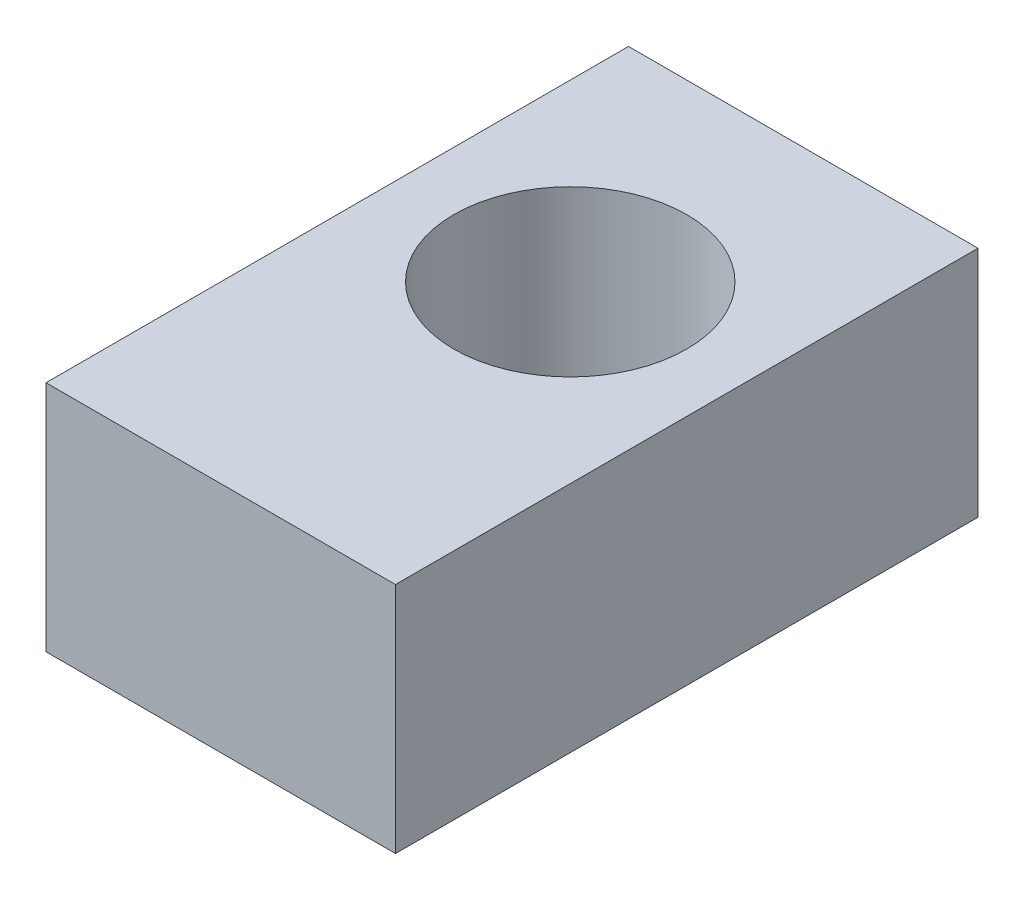
ISO-10303-21;
HEADER;
FILE_DESCRIPTION(('STEP AP214'),'2;1');
FILE_NAME('part.step','',(''),(''),'','','');
FILE_SCHEMA(('AUTOMOTIVE_DESIGN { 1 0 10303 214 1 1 1 1 }'));
ENDSEC;
DATA;
#1=APPLICATION_CONTEXT('core data for automotive mechanical design processes');
#2=APPLICATION_PROTOCOL_DEFINITION('international standard','automotive_design',2000,#1);
#3=PRODUCT_CONTEXT('',#1,'mechanical');
#4=PRODUCT('Part','Part','',(#3));
#5=PRODUCT_RELATED_PRODUCT_CATEGORY('part','',(#4));
#6=PRODUCT_DEFINITION_FORMATION('','',#4);
#7=PRODUCT_DEFINITION_CONTEXT('part definition',#1,'design');
#8=PRODUCT_DEFINITION('design','',#6,#7);
#9=PRODUCT_DEFINITION_SHAPE('','',#8);
#10=(LENGTH_UNIT() NAMED_UNIT(*) SI_UNIT(.MILLI.,.METRE.));
#11=(NAMED_UNIT(*) PLANE_ANGLE_UNIT() SI_UNIT($,.RADIAN.));
#12=(NAMED_UNIT(*) SI_UNIT($,.STERADIAN.) SOLID_ANGLE_UNIT());
#13=UNCERTAINTY_MEASURE_WITH_UNIT(LENGTH_MEASURE(1.E-05),#10,'distance_accuracy_value','');
#14=(GEOMETRIC_REPRESENTATION_CONTEXT(3) GLOBAL_UNCERTAINTY_ASSIGNED_CONTEXT((#13)) GLOBAL_UNIT_ASSIGNED_CONTEXT((#10,
#11,#12)) REPRESENTATION_CONTEXT('',''));
#15=CARTESIAN_POINT('',(0.,0.,0.));
#16=DIRECTION('',(0.,0.,1.));
#17=DIRECTION('',(1.,0.,0.));
#18=AXIS2_PLACEMENT_3D('',#15,#16,#17);
#19=CARTESIAN_POINT('',(0.,10.,0.));
#20=DIRECTION('',(0.,-1.,0.));
#21=DIRECTION('',(0.,0.,-1.));
#22=AXIS2_PLACEMENT_3D('',#19,#20,#21);
#23=PLANE('',#22);
#24=DIRECTION('',(1.,0.,0.));
#25=VECTOR('',#24,1.);
#26=CARTESIAN_POINT('',(30.,10.,0.));
#27=LINE('',#26,#25);
#28=CARTESIAN_POINT('',(0.,10.,0.));
#29=VERTEX_POINT('',#28);
#30=CARTESIAN_POINT('',(30.,10.,0.));
#31=VERTEX_POINT('',#30);
#32=EDGE_CURVE('E96',#29,#31,#27,.T.);
#33=ORIENTED_EDGE('',*,*,#32,.T.);
#34=DIRECTION('',(0.,0.,-1.));
#35=VECTOR('',#34,1.);
#36=CARTESIAN_POINT('',(30.,10.,-50.));
#37=LINE('',#36,#35);
#38=CARTESIAN_POINT('',(30.,10.,-50.));
#39=VERTEX_POINT('',#38);
#40=EDGE_CURVE('E91',#31,#39,#37,.T.);
#41=ORIENTED_EDGE('',*,*,#40,.T.);
#42=DIRECTION('',(-1.,0.,0.));
#43=VECTOR('',#42,1.);
#44=CARTESIAN_POINT('',(0.,10.,-50.));
#45=LINE('',#44,#43);
#46=CARTESIAN_POINT('',(0.,10.,-50.));
#47=VERTEX_POINT('',#46);
#48=EDGE_CURVE('E94',#39,#47,#45,.T.);
#49=ORIENTED_EDGE('',*,*,#48,.T.);
#50=DIRECTION('',(0.,0.,1.));
#51=VECTOR('',#50,1.);
#52=CARTESIAN_POINT('',(0.,10.,0.));
#53=LINE('',#52,#51);
#54=EDGE_CURVE('E61',#47,#29,#53,.T.);
#55=ORIENTED_EDGE('',*,*,#54,.T.);
#56=EDGE_LOOP('',(#33,#41,#49,#55));
#57=FACE_BOUND('',#56,.T.);
#58=CARTESIAN_POINT('',(15.,10.,-30.));
#59=DIRECTION('',(0.,1.,0.));
#60=DIRECTION('',(0.,0.,1.));
#61=AXIS2_PLACEMENT_3D('',#58,#59,#60);
#62=CIRCLE('',#61,10.);
#63=CARTESIAN_POINT('',(15.,10.,-20.));
#64=VERTEX_POINT('',#63);
#65=EDGE_CURVE('E116',#64,#64,#62,.T.);
#66=ORIENTED_EDGE('',*,*,#65,.F.);
#67=EDGE_LOOP('',(#66));
#68=FACE_BOUND('',#67,.T.);
#69=ADVANCED_FACE('F43',(#57,#68),#23,.F.);
#70=CARTESIAN_POINT('',(0.,-10.,0.));
#71=DIRECTION('',(0.,-1.,0.));
#72=DIRECTION('',(0.,0.,-1.));
#73=AXIS2_PLACEMENT_3D('',#70,#71,#72);
#74=PLANE('',#73);
#75=DIRECTION('',(1.,0.,0.));
#76=VECTOR('',#75,1.);
#77=CARTESIAN_POINT('',(30.,-10.,0.));
#78=LINE('',#77,#76);
#79=CARTESIAN_POINT('',(0.,-10.,0.));
#80=VERTEX_POINT('',#79);
#81=CARTESIAN_POINT('',(30.,-10.,0.));
#82=VERTEX_POINT('',#81);
#83=EDGE_CURVE('E112',#80,#82,#78,.T.);
#84=ORIENTED_EDGE('',*,*,#83,.F.);
#85=DIRECTION('',(0.,0.,1.));
#86=VECTOR('',#85,1.);
#87=CARTESIAN_POINT('',(0.,-10.,0.));
#88=LINE('',#87,#86);
#89=CARTESIAN_POINT('',(0.,-10.,-50.));
#90=VERTEX_POINT('',#89);
#91=EDGE_CURVE('E84',#90,#80,#88,.T.);
#92=ORIENTED_EDGE('',*,*,#91,.F.);
#93=DIRECTION('',(-1.,0.,0.));
#94=VECTOR('',#93,1.);
#95=CARTESIAN_POINT('',(0.,-10.,-50.));
#96=LINE('',#95,#94);
#97=CARTESIAN_POINT('',(30.,-10.,-50.));
#98=VERTEX_POINT('',#97);
#99=EDGE_CURVE('E78',#98,#90,#96,.T.);
#100=ORIENTED_EDGE('',*,*,#99,.F.);
#101=DIRECTION('',(0.,0.,-1.));
#102=VECTOR('',#101,1.);
#103=CARTESIAN_POINT('',(30.,-10.,-50.));
#104=LINE('',#103,#102);
#105=EDGE_CURVE('E101',#82,#98,#104,.T.);
#106=ORIENTED_EDGE('',*,*,#105,.F.);
#107=EDGE_LOOP('',(#84,#92,#100,#106));
#108=FACE_BOUND('',#107,.T.);
#109=CARTESIAN_POINT('',(15.,-10.,-30.));
#110=DIRECTION('',(0.,1.,0.));
#111=DIRECTION('',(0.,0.,1.));
#112=AXIS2_PLACEMENT_3D('',#109,#110,#111);
#113=CIRCLE('',#112,10.);
#114=CARTESIAN_POINT('',(15.,-10.,-20.));
#115=VERTEX_POINT('',#114);
#116=EDGE_CURVE('E134',#115,#115,#113,.T.);
#117=ORIENTED_EDGE('',*,*,#116,.T.);
#118=EDGE_LOOP('',(#117));
#119=FACE_BOUND('',#118,.T.);
#120=ADVANCED_FACE('F129',(#108,#119),#74,.T.);
#121=CARTESIAN_POINT('',(30.,10.,0.));
#122=DIRECTION('',(0.,0.,-1.));
#123=DIRECTION('',(-1.,0.,0.));
#124=AXIS2_PLACEMENT_3D('',#121,#122,#123);
#125=PLANE('',#124);
#126=ORIENTED_EDGE('',*,*,#83,.T.);
#127=DIRECTION('',(0.,-1.,0.));
#128=VECTOR('',#127,1.);
#129=CARTESIAN_POINT('',(30.,10.,0.));
#130=LINE('',#129,#128);
#131=EDGE_CURVE('E11',#31,#82,#130,.T.);
#132=ORIENTED_EDGE('',*,*,#131,.F.);
#133=ORIENTED_EDGE('',*,*,#32,.F.);
#134=DIRECTION('',(0.,-1.,0.));
#135=VECTOR('',#134,1.);
#136=CARTESIAN_POINT('',(0.,10.,0.));
#137=LINE('',#136,#135);
#138=EDGE_CURVE('E108',#29,#80,#137,.T.);
#139=ORIENTED_EDGE('',*,*,#138,.T.);
#140=EDGE_LOOP('',(#126,#132,#133,#139));
#141=FACE_BOUND('',#140,.T.);
#142=ADVANCED_FACE('F45',(#141),#125,.F.);
#143=CARTESIAN_POINT('',(30.,10.,-50.));
#144=DIRECTION('',(-1.,0.,0.));
#145=DIRECTION('',(0.,0.,1.));
#146=AXIS2_PLACEMENT_3D('',#143,#144,#145);
#147=PLANE('',#146);
#148=ORIENTED_EDGE('',*,*,#105,.T.);
#149=DIRECTION('',(0.,-1.,0.));
#150=VECTOR('',#149,1.);
#151=CARTESIAN_POINT('',(30.,10.,-50.));
#152=LINE('',#151,#150);
#153=EDGE_CURVE('E53',#39,#98,#152,.T.);
#154=ORIENTED_EDGE('',*,*,#153,.F.);
#155=ORIENTED_EDGE('',*,*,#40,.F.);
#156=ORIENTED_EDGE('',*,*,#131,.T.);
#157=EDGE_LOOP('',(#148,#154,#155,#156));
#158=FACE_BOUND('',#157,.T.);
#159=ADVANCED_FACE('F100',(#158),#147,.F.);
#160=CARTESIAN_POINT('',(0.,10.,-50.));
#161=DIRECTION('',(0.,0.,1.));
#162=DIRECTION('',(1.,0.,0.));
#163=AXIS2_PLACEMENT_3D('',#160,#161,#162);
#164=PLANE('',#163);
#165=ORIENTED_EDGE('',*,*,#99,.T.);
#166=DIRECTION('',(0.,-1.,0.));
#167=VECTOR('',#166,1.);
#168=CARTESIAN_POINT('',(0.,10.,-50.));
#169=LINE('',#168,#167);
#170=EDGE_CURVE('E103',#47,#90,#169,.T.);
#171=ORIENTED_EDGE('',*,*,#170,.F.);
#172=ORIENTED_EDGE('',*,*,#48,.F.);
#173=ORIENTED_EDGE('',*,*,#153,.T.);
#174=EDGE_LOOP('',(#165,#171,#172,#173));
#175=FACE_BOUND('',#174,.T.);
#176=ADVANCED_FACE('F104',(#175),#164,.F.);
#177=CARTESIAN_POINT('',(0.,10.,0.));
#178=DIRECTION('',(1.,0.,0.));
#179=DIRECTION('',(0.,0.,-1.));
#180=AXIS2_PLACEMENT_3D('',#177,#178,#179);
#181=PLANE('',#180);
#182=ORIENTED_EDGE('',*,*,#91,.T.);
#183=ORIENTED_EDGE('',*,*,#138,.F.);
#184=ORIENTED_EDGE('',*,*,#54,.F.);
#185=ORIENTED_EDGE('',*,*,#170,.T.);
#186=EDGE_LOOP('',(#182,#183,#184,#185));
#187=FACE_BOUND('',#186,.T.);
#188=ADVANCED_FACE('F126',(#187),#181,.F.);
#189=CARTESIAN_POINT('',(15.,10.,-30.));
#190=DIRECTION('',(0.,-1.,0.));
#191=DIRECTION('',(0.,0.,-1.));
#192=AXIS2_PLACEMENT_3D('',#189,#190,#191);
#193=CYLINDRICAL_SURFACE('',#192,10.);
#194=ORIENTED_EDGE('',*,*,#65,.T.);
#195=EDGE_LOOP('',(#194));
#196=FACE_BOUND('',#195,.T.);
#197=ORIENTED_EDGE('',*,*,#116,.F.);
#198=EDGE_LOOP('',(#197));
#199=FACE_BOUND('',#198,.T.);
#200=ADVANCED_FACE('F142',(#196,#199),#193,.F.);
#201=CLOSED_SHELL('',(#69,#120,#142,#159,#176,#188,#200));
#202=MANIFOLD_SOLID_BREP('B2',#201);
#203=ADVANCED_BREP_SHAPE_REPRESENTATION('',(#18,#202),#14);
#204=SHAPE_DEFINITION_REPRESENTATION(#9,#203);
ENDSEC;
END-ISO-10303-21;
